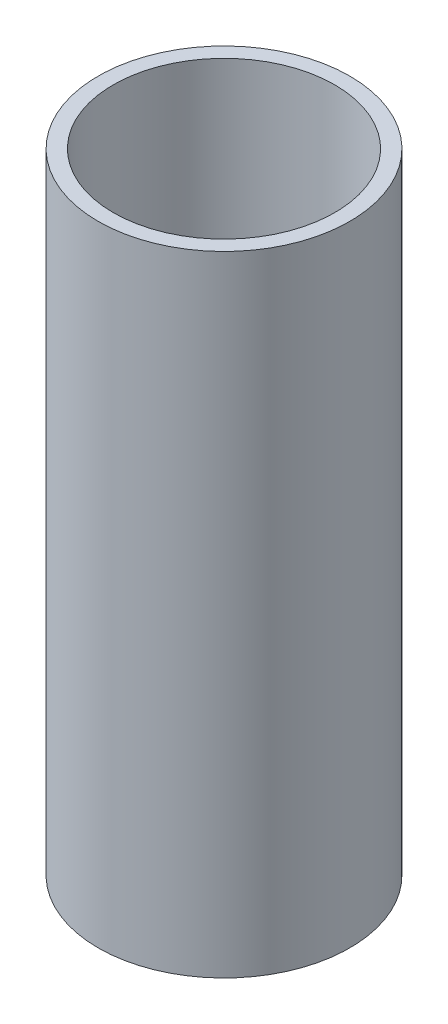
ISO-10303-21;
HEADER;
FILE_DESCRIPTION(('STEP AP214'),'2;1');
FILE_NAME('part.step','',(''),(''),'','','');
FILE_SCHEMA(('AUTOMOTIVE_DESIGN { 1 0 10303 214 1 1 1 1 }'));
ENDSEC;
DATA;
#1=APPLICATION_CONTEXT('core data for automotive mechanical design processes');
#2=APPLICATION_PROTOCOL_DEFINITION('international standard','automotive_design',2000,#1);
#3=PRODUCT_CONTEXT('',#1,'mechanical');
#4=PRODUCT('Part','Part','',(#3));
#5=PRODUCT_RELATED_PRODUCT_CATEGORY('part','',(#4));
#6=PRODUCT_DEFINITION_FORMATION('','',#4);
#7=PRODUCT_DEFINITION_CONTEXT('part definition',#1,'design');
#8=PRODUCT_DEFINITION('design','',#6,#7);
#9=PRODUCT_DEFINITION_SHAPE('','',#8);
#10=(LENGTH_UNIT() NAMED_UNIT(*) SI_UNIT(.MILLI.,.METRE.));
#11=(NAMED_UNIT(*) PLANE_ANGLE_UNIT() SI_UNIT($,.RADIAN.));
#12=(NAMED_UNIT(*) SI_UNIT($,.STERADIAN.) SOLID_ANGLE_UNIT());
#13=UNCERTAINTY_MEASURE_WITH_UNIT(LENGTH_MEASURE(1.E-05),#10,'distance_accuracy_value','');
#14=(GEOMETRIC_REPRESENTATION_CONTEXT(3) GLOBAL_UNCERTAINTY_ASSIGNED_CONTEXT((#13)) GLOBAL_UNIT_ASSIGNED_CONTEXT((#10,
#11,#12)) REPRESENTATION_CONTEXT('',''));
#15=CARTESIAN_POINT('',(0.,0.,0.));
#16=DIRECTION('',(0.,0.,1.));
#17=DIRECTION('',(1.,0.,0.));
#18=AXIS2_PLACEMENT_3D('',#15,#16,#17);
#19=CARTESIAN_POINT('',(0.,125.,0.));
#20=DIRECTION('',(0.,1.,0.));
#21=DIRECTION('',(0.,0.,1.));
#22=AXIS2_PLACEMENT_3D('',#19,#20,#21);
#23=PLANE('',#22);
#24=CARTESIAN_POINT('',(0.,125.,0.));
#25=DIRECTION('',(0.,1.,0.));
#26=DIRECTION('',(0.,0.,1.));
#27=AXIS2_PLACEMENT_3D('',#24,#25,#26);
#28=CIRCLE('',#27,25.);
#29=CARTESIAN_POINT('',(0.,125.,25.));
#30=VERTEX_POINT('',#29);
#31=EDGE_CURVE('E10',#30,#30,#28,.T.);
#32=ORIENTED_EDGE('',*,*,#31,.T.);
#33=EDGE_LOOP('',(#32));
#34=FACE_BOUND('',#33,.T.);
#35=CARTESIAN_POINT('',(0.,125.,0.));
#36=DIRECTION('',(0.,1.,0.));
#37=DIRECTION('',(0.,0.,1.));
#38=AXIS2_PLACEMENT_3D('',#35,#36,#37);
#39=CIRCLE('',#38,22.);
#40=CARTESIAN_POINT('',(0.,125.,22.));
#41=VERTEX_POINT('',#40);
#42=EDGE_CURVE('E42',#41,#41,#39,.T.);
#43=ORIENTED_EDGE('',*,*,#42,.F.);
#44=EDGE_LOOP('',(#43));
#45=FACE_BOUND('',#44,.T.);
#46=ADVANCED_FACE('F31',(#34,#45),#23,.T.);
#47=CARTESIAN_POINT('',(0.,0.,0.));
#48=DIRECTION('',(0.,1.,0.));
#49=DIRECTION('',(0.,0.,1.));
#50=AXIS2_PLACEMENT_3D('',#47,#48,#49);
#51=PLANE('',#50);
#52=CARTESIAN_POINT('',(0.,0.,0.));
#53=DIRECTION('',(0.,1.,0.));
#54=DIRECTION('',(0.,0.,1.));
#55=AXIS2_PLACEMENT_3D('',#52,#53,#54);
#56=CIRCLE('',#55,25.);
#57=CARTESIAN_POINT('',(0.,0.,25.));
#58=VERTEX_POINT('',#57);
#59=EDGE_CURVE('E35',#58,#58,#56,.T.);
#60=ORIENTED_EDGE('',*,*,#59,.F.);
#61=EDGE_LOOP('',(#60));
#62=FACE_BOUND('',#61,.T.);
#63=CARTESIAN_POINT('',(0.,0.,0.));
#64=DIRECTION('',(0.,1.,0.));
#65=DIRECTION('',(0.,0.,1.));
#66=AXIS2_PLACEMENT_3D('',#63,#64,#65);
#67=CIRCLE('',#66,22.);
#68=CARTESIAN_POINT('',(0.,0.,22.));
#69=VERTEX_POINT('',#68);
#70=EDGE_CURVE('E44',#69,#69,#67,.T.);
#71=ORIENTED_EDGE('',*,*,#70,.T.);
#72=EDGE_LOOP('',(#71));
#73=FACE_BOUND('',#72,.T.);
#74=ADVANCED_FACE('F54',(#62,#73),#51,.F.);
#75=CARTESIAN_POINT('',(0.,125.,0.));
#76=DIRECTION('',(0.,-1.,0.));
#77=DIRECTION('',(0.,0.,-1.));
#78=AXIS2_PLACEMENT_3D('',#75,#76,#77);
#79=CYLINDRICAL_SURFACE('',#78,25.);
#80=ORIENTED_EDGE('',*,*,#31,.F.);
#81=EDGE_LOOP('',(#80));
#82=FACE_BOUND('',#81,.T.);
#83=ORIENTED_EDGE('',*,*,#59,.T.);
#84=EDGE_LOOP('',(#83));
#85=FACE_BOUND('',#84,.T.);
#86=ADVANCED_FACE('F33',(#82,#85),#79,.T.);
#87=CARTESIAN_POINT('',(0.,125.,0.));
#88=DIRECTION('',(0.,-1.,0.));
#89=DIRECTION('',(0.,0.,-1.));
#90=AXIS2_PLACEMENT_3D('',#87,#88,#89);
#91=CYLINDRICAL_SURFACE('',#90,22.);
#92=ORIENTED_EDGE('',*,*,#42,.T.);
#93=EDGE_LOOP('',(#92));
#94=FACE_BOUND('',#93,.T.);
#95=ORIENTED_EDGE('',*,*,#70,.F.);
#96=EDGE_LOOP('',(#95));
#97=FACE_BOUND('',#96,.T.);
#98=ADVANCED_FACE('F50',(#94,#97),#91,.F.);
#99=CLOSED_SHELL('',(#46,#74,#86,#98));
#100=MANIFOLD_SOLID_BREP('B2',#99);
#101=ADVANCED_BREP_SHAPE_REPRESENTATION('',(#18,#100),#14);
#102=SHAPE_DEFINITION_REPRESENTATION(#9,#101);
ENDSEC;
END-ISO-10303-21;
